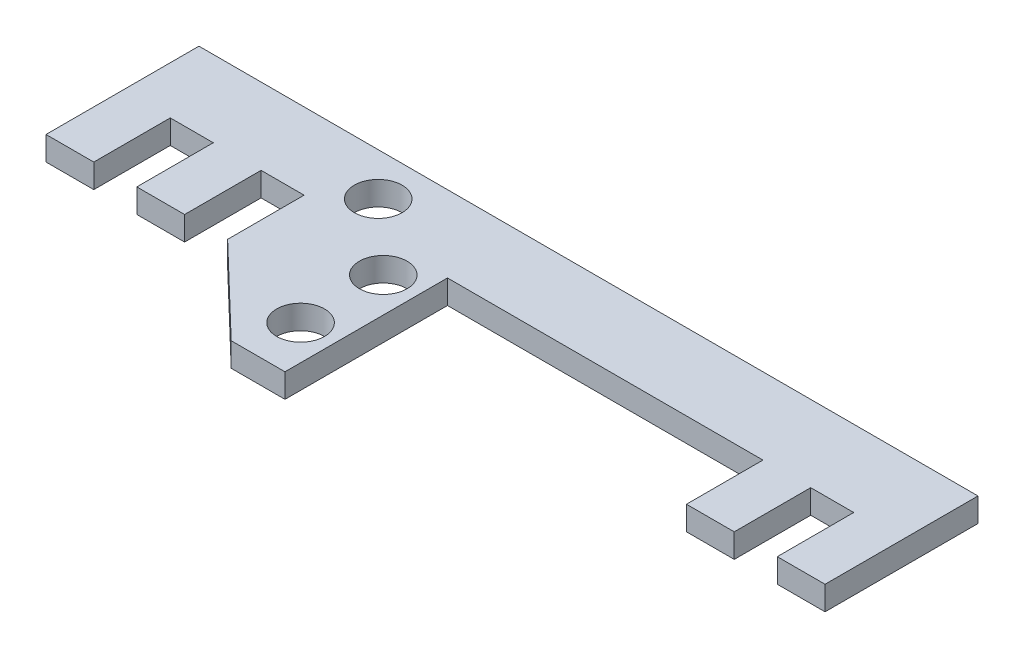
ISO-10303-21;
HEADER;
FILE_DESCRIPTION(('STEP AP214'),'2;1');
FILE_NAME('part.step','',(''),(''),'','','');
FILE_SCHEMA(('AUTOMOTIVE_DESIGN { 1 0 10303 214 1 1 1 1 }'));
ENDSEC;
DATA;
#1=APPLICATION_CONTEXT('core data for automotive mechanical design processes');
#2=APPLICATION_PROTOCOL_DEFINITION('international standard','automotive_design',2000,#1);
#3=PRODUCT_CONTEXT('',#1,'mechanical');
#4=PRODUCT('Part','Part','',(#3));
#5=PRODUCT_RELATED_PRODUCT_CATEGORY('part','',(#4));
#6=PRODUCT_DEFINITION_FORMATION('','',#4);
#7=PRODUCT_DEFINITION_CONTEXT('part definition',#1,'design');
#8=PRODUCT_DEFINITION('design','',#6,#7);
#9=PRODUCT_DEFINITION_SHAPE('','',#8);
#10=(LENGTH_UNIT() NAMED_UNIT(*) SI_UNIT(.MILLI.,.METRE.));
#11=(NAMED_UNIT(*) PLANE_ANGLE_UNIT() SI_UNIT($,.RADIAN.));
#12=(NAMED_UNIT(*) SI_UNIT($,.STERADIAN.) SOLID_ANGLE_UNIT());
#13=UNCERTAINTY_MEASURE_WITH_UNIT(LENGTH_MEASURE(1.E-05),#10,'distance_accuracy_value','');
#14=(GEOMETRIC_REPRESENTATION_CONTEXT(3) GLOBAL_UNCERTAINTY_ASSIGNED_CONTEXT((#13)) GLOBAL_UNIT_ASSIGNED_CONTEXT((#10,
#11,#12)) REPRESENTATION_CONTEXT('',''));
#15=CARTESIAN_POINT('',(0.,0.,0.));
#16=DIRECTION('',(0.,0.,1.));
#17=DIRECTION('',(1.,0.,0.));
#18=AXIS2_PLACEMENT_3D('',#15,#16,#17);
#19=CARTESIAN_POINT('',(0.,1.,0.));
#20=DIRECTION('',(0.,0.,-1.));
#21=DIRECTION('',(-1.,0.,0.));
#22=AXIS2_PLACEMENT_3D('',#19,#20,#21);
#23=PLANE('',#22);
#24=DIRECTION('',(1.,0.,0.));
#25=VECTOR('',#24,1.);
#26=CARTESIAN_POINT('',(0.,0.,0.));
#27=LINE('',#26,#25);
#28=CARTESIAN_POINT('',(0.,0.,0.));
#29=VERTEX_POINT('',#28);
#30=CARTESIAN_POINT('',(2.,0.,0.));
#31=VERTEX_POINT('',#30);
#32=EDGE_CURVE('E208',#29,#31,#27,.T.);
#33=ORIENTED_EDGE('',*,*,#32,.T.);
#34=DIRECTION('',(0.,-1.,0.));
#35=VECTOR('',#34,1.);
#36=CARTESIAN_POINT('',(2.,1.,0.));
#37=LINE('',#36,#35);
#38=CARTESIAN_POINT('',(2.,1.,0.));
#39=VERTEX_POINT('',#38);
#40=EDGE_CURVE('E11',#39,#31,#37,.T.);
#41=ORIENTED_EDGE('',*,*,#40,.F.);
#42=DIRECTION('',(1.,0.,0.));
#43=VECTOR('',#42,1.);
#44=CARTESIAN_POINT('',(0.,1.,0.));
#45=LINE('',#44,#43);
#46=CARTESIAN_POINT('',(0.,1.,0.));
#47=VERTEX_POINT('',#46);
#48=EDGE_CURVE('E249',#47,#39,#45,.T.);
#49=ORIENTED_EDGE('',*,*,#48,.F.);
#50=DIRECTION('',(0.,-1.,0.));
#51=VECTOR('',#50,1.);
#52=CARTESIAN_POINT('',(0.,1.,0.));
#53=LINE('',#52,#51);
#54=EDGE_CURVE('E204',#47,#29,#53,.T.);
#55=ORIENTED_EDGE('',*,*,#54,.T.);
#56=EDGE_LOOP('',(#33,#41,#49,#55));
#57=FACE_BOUND('',#56,.T.);
#58=ADVANCED_FACE('F34',(#57),#23,.F.);
#59=CARTESIAN_POINT('',(2.,1.,0.));
#60=DIRECTION('',(-1.,0.,0.));
#61=DIRECTION('',(0.,0.,1.));
#62=AXIS2_PLACEMENT_3D('',#59,#60,#61);
#63=PLANE('',#62);
#64=DIRECTION('',(0.,0.,-1.));
#65=VECTOR('',#64,1.);
#66=CARTESIAN_POINT('',(2.,0.,0.));
#67=LINE('',#66,#65);
#68=CARTESIAN_POINT('',(2.,0.,-3.2));
#69=VERTEX_POINT('',#68);
#70=EDGE_CURVE('E211',#31,#69,#67,.T.);
#71=ORIENTED_EDGE('',*,*,#70,.T.);
#72=DIRECTION('',(0.,-1.,0.));
#73=VECTOR('',#72,1.);
#74=CARTESIAN_POINT('',(2.,1.,-3.2));
#75=LINE('',#74,#73);
#76=CARTESIAN_POINT('',(2.,1.,-3.2));
#77=VERTEX_POINT('',#76);
#78=EDGE_CURVE('E42',#77,#69,#75,.T.);
#79=ORIENTED_EDGE('',*,*,#78,.F.);
#80=DIRECTION('',(0.,0.,-1.));
#81=VECTOR('',#80,1.);
#82=CARTESIAN_POINT('',(2.,1.,0.));
#83=LINE('',#82,#81);
#84=EDGE_CURVE('E132',#39,#77,#83,.T.);
#85=ORIENTED_EDGE('',*,*,#84,.F.);
#86=ORIENTED_EDGE('',*,*,#40,.T.);
#87=EDGE_LOOP('',(#71,#79,#85,#86));
#88=FACE_BOUND('',#87,.T.);
#89=ADVANCED_FACE('F373',(#88),#63,.F.);
#90=CARTESIAN_POINT('',(2.,1.,-3.2));
#91=DIRECTION('',(0.,0.,-1.));
#92=DIRECTION('',(-1.,0.,0.));
#93=AXIS2_PLACEMENT_3D('',#90,#91,#92);
#94=PLANE('',#93);
#95=DIRECTION('',(1.,0.,0.));
#96=VECTOR('',#95,1.);
#97=CARTESIAN_POINT('',(2.,0.,-3.2));
#98=LINE('',#97,#96);
#99=CARTESIAN_POINT('',(3.8,0.,-3.2));
#100=VERTEX_POINT('',#99);
#101=EDGE_CURVE('E214',#69,#100,#98,.T.);
#102=ORIENTED_EDGE('',*,*,#101,.T.);
#103=DIRECTION('',(0.,-1.,0.));
#104=VECTOR('',#103,1.);
#105=CARTESIAN_POINT('',(3.8,1.,-3.2));
#106=LINE('',#105,#104);
#107=CARTESIAN_POINT('',(3.8,1.,-3.2));
#108=VERTEX_POINT('',#107);
#109=EDGE_CURVE('E295',#108,#100,#106,.T.);
#110=ORIENTED_EDGE('',*,*,#109,.F.);
#111=DIRECTION('',(1.,0.,0.));
#112=VECTOR('',#111,1.);
#113=CARTESIAN_POINT('',(2.,1.,-3.2));
#114=LINE('',#113,#112);
#115=EDGE_CURVE('E303',#77,#108,#114,.T.);
#116=ORIENTED_EDGE('',*,*,#115,.F.);
#117=ORIENTED_EDGE('',*,*,#78,.T.);
#118=EDGE_LOOP('',(#102,#110,#116,#117));
#119=FACE_BOUND('',#118,.T.);
#120=ADVANCED_FACE('F301',(#119),#94,.F.);
#121=CARTESIAN_POINT('',(3.8,1.,-3.2));
#122=DIRECTION('',(1.,0.,0.));
#123=DIRECTION('',(0.,0.,-1.));
#124=AXIS2_PLACEMENT_3D('',#121,#122,#123);
#125=PLANE('',#124);
#126=DIRECTION('',(0.,0.,1.));
#127=VECTOR('',#126,1.);
#128=CARTESIAN_POINT('',(3.8,0.,-3.2));
#129=LINE('',#128,#127);
#130=CARTESIAN_POINT('',(3.8,0.,0.));
#131=VERTEX_POINT('',#130);
#132=EDGE_CURVE('E216',#100,#131,#129,.T.);
#133=ORIENTED_EDGE('',*,*,#132,.T.);
#134=DIRECTION('',(0.,-1.,0.));
#135=VECTOR('',#134,1.);
#136=CARTESIAN_POINT('',(3.8,1.,0.));
#137=LINE('',#136,#135);
#138=CARTESIAN_POINT('',(3.8,1.,0.));
#139=VERTEX_POINT('',#138);
#140=EDGE_CURVE('E292',#139,#131,#137,.T.);
#141=ORIENTED_EDGE('',*,*,#140,.F.);
#142=DIRECTION('',(0.,0.,1.));
#143=VECTOR('',#142,1.);
#144=CARTESIAN_POINT('',(3.8,1.,-3.2));
#145=LINE('',#144,#143);
#146=EDGE_CURVE('E321',#108,#139,#145,.T.);
#147=ORIENTED_EDGE('',*,*,#146,.F.);
#148=ORIENTED_EDGE('',*,*,#109,.T.);
#149=EDGE_LOOP('',(#133,#141,#147,#148));
#150=FACE_BOUND('',#149,.T.);
#151=ADVANCED_FACE('F312',(#150),#125,.F.);
#152=CARTESIAN_POINT('',(3.8,1.,0.));
#153=DIRECTION('',(0.,0.,-1.));
#154=DIRECTION('',(-1.,0.,0.));
#155=AXIS2_PLACEMENT_3D('',#152,#153,#154);
#156=PLANE('',#155);
#157=DIRECTION('',(1.,0.,0.));
#158=VECTOR('',#157,1.);
#159=CARTESIAN_POINT('',(3.8,0.,0.));
#160=LINE('',#159,#158);
#161=CARTESIAN_POINT('',(5.8,0.,0.));
#162=VERTEX_POINT('',#161);
#163=EDGE_CURVE('E218',#131,#162,#160,.T.);
#164=ORIENTED_EDGE('',*,*,#163,.T.);
#165=DIRECTION('',(0.,-1.,0.));
#166=VECTOR('',#165,1.);
#167=CARTESIAN_POINT('',(5.8,1.,0.));
#168=LINE('',#167,#166);
#169=CARTESIAN_POINT('',(5.8,1.,0.));
#170=VERTEX_POINT('',#169);
#171=EDGE_CURVE('E289',#170,#162,#168,.T.);
#172=ORIENTED_EDGE('',*,*,#171,.F.);
#173=DIRECTION('',(1.,0.,0.));
#174=VECTOR('',#173,1.);
#175=CARTESIAN_POINT('',(3.8,1.,0.));
#176=LINE('',#175,#174);
#177=EDGE_CURVE('E318',#139,#170,#176,.T.);
#178=ORIENTED_EDGE('',*,*,#177,.F.);
#179=ORIENTED_EDGE('',*,*,#140,.T.);
#180=EDGE_LOOP('',(#164,#172,#178,#179));
#181=FACE_BOUND('',#180,.T.);
#182=ADVANCED_FACE('F316',(#181),#156,.F.);
#183=CARTESIAN_POINT('',(5.8,1.,0.));
#184=DIRECTION('',(-1.,0.,0.));
#185=DIRECTION('',(0.,0.,1.));
#186=AXIS2_PLACEMENT_3D('',#183,#184,#185);
#187=PLANE('',#186);
#188=DIRECTION('',(0.,0.,-1.));
#189=VECTOR('',#188,1.);
#190=CARTESIAN_POINT('',(5.8,0.,0.));
#191=LINE('',#190,#189);
#192=CARTESIAN_POINT('',(5.8,0.,-3.2));
#193=VERTEX_POINT('',#192);
#194=EDGE_CURVE('E220',#162,#193,#191,.T.);
#195=ORIENTED_EDGE('',*,*,#194,.T.);
#196=DIRECTION('',(0.,-1.,0.));
#197=VECTOR('',#196,1.);
#198=CARTESIAN_POINT('',(5.8,1.,-3.2));
#199=LINE('',#198,#197);
#200=CARTESIAN_POINT('',(5.8,1.,-3.2));
#201=VERTEX_POINT('',#200);
#202=EDGE_CURVE('E286',#201,#193,#199,.T.);
#203=ORIENTED_EDGE('',*,*,#202,.F.);
#204=DIRECTION('',(0.,0.,-1.));
#205=VECTOR('',#204,1.);
#206=CARTESIAN_POINT('',(5.8,1.,0.));
#207=LINE('',#206,#205);
#208=EDGE_CURVE('E320',#170,#201,#207,.T.);
#209=ORIENTED_EDGE('',*,*,#208,.F.);
#210=ORIENTED_EDGE('',*,*,#171,.T.);
#211=EDGE_LOOP('',(#195,#203,#209,#210));
#212=FACE_BOUND('',#211,.T.);
#213=ADVANCED_FACE('F386',(#212),#187,.F.);
#214=CARTESIAN_POINT('',(5.8,1.,-3.2));
#215=DIRECTION('',(0.,0.,-1.));
#216=DIRECTION('',(-1.,0.,0.));
#217=AXIS2_PLACEMENT_3D('',#214,#215,#216);
#218=PLANE('',#217);
#219=DIRECTION('',(1.,0.,0.));
#220=VECTOR('',#219,1.);
#221=CARTESIAN_POINT('',(5.8,0.,-3.2));
#222=LINE('',#221,#220);
#223=CARTESIAN_POINT('',(7.6,0.,-3.2));
#224=VERTEX_POINT('',#223);
#225=EDGE_CURVE('E222',#193,#224,#222,.T.);
#226=ORIENTED_EDGE('',*,*,#225,.T.);
#227=DIRECTION('',(0.,-1.,0.));
#228=VECTOR('',#227,1.);
#229=CARTESIAN_POINT('',(7.6,1.,-3.2));
#230=LINE('',#229,#228);
#231=CARTESIAN_POINT('',(7.6,1.,-3.2));
#232=VERTEX_POINT('',#231);
#233=EDGE_CURVE('E283',#232,#224,#230,.T.);
#234=ORIENTED_EDGE('',*,*,#233,.F.);
#235=DIRECTION('',(1.,0.,0.));
#236=VECTOR('',#235,1.);
#237=CARTESIAN_POINT('',(5.8,1.,-3.2));
#238=LINE('',#237,#236);
#239=EDGE_CURVE('E323',#201,#232,#238,.T.);
#240=ORIENTED_EDGE('',*,*,#239,.F.);
#241=ORIENTED_EDGE('',*,*,#202,.T.);
#242=EDGE_LOOP('',(#226,#234,#240,#241));
#243=FACE_BOUND('',#242,.T.);
#244=ADVANCED_FACE('F389',(#243),#218,.F.);
#245=CARTESIAN_POINT('',(7.6,1.,-3.2));
#246=DIRECTION('',(1.,0.,0.));
#247=DIRECTION('',(0.,0.,-1.));
#248=AXIS2_PLACEMENT_3D('',#245,#246,#247);
#249=PLANE('',#248);
#250=DIRECTION('',(0.,0.,1.));
#251=VECTOR('',#250,1.);
#252=CARTESIAN_POINT('',(7.6,0.,-3.2));
#253=LINE('',#252,#251);
#254=CARTESIAN_POINT('',(7.6,0.,0.));
#255=VERTEX_POINT('',#254);
#256=EDGE_CURVE('E224',#224,#255,#253,.T.);
#257=ORIENTED_EDGE('',*,*,#256,.T.);
#258=DIRECTION('',(0.,-1.,0.));
#259=VECTOR('',#258,1.);
#260=CARTESIAN_POINT('',(7.6,1.,0.));
#261=LINE('',#260,#259);
#262=CARTESIAN_POINT('',(7.6,1.,0.));
#263=VERTEX_POINT('',#262);
#264=EDGE_CURVE('E280',#263,#255,#261,.T.);
#265=ORIENTED_EDGE('',*,*,#264,.F.);
#266=DIRECTION('',(0.,0.,1.));
#267=VECTOR('',#266,1.);
#268=CARTESIAN_POINT('',(7.6,1.,-3.2));
#269=LINE('',#268,#267);
#270=EDGE_CURVE('E329',#232,#263,#269,.T.);
#271=ORIENTED_EDGE('',*,*,#270,.F.);
#272=ORIENTED_EDGE('',*,*,#233,.T.);
#273=EDGE_LOOP('',(#257,#265,#271,#272));
#274=FACE_BOUND('',#273,.T.);
#275=ADVANCED_FACE('F393',(#274),#249,.F.);
#276=CARTESIAN_POINT('',(7.6,1.,0.));
#277=DIRECTION('',(0.692531828189713,0.,-0.721387321030952));
#278=DIRECTION('',(-0.721387321030952,0.,-0.692531828189713));
#279=AXIS2_PLACEMENT_3D('',#276,#277,#278);
#280=PLANE('',#279);
#281=DIRECTION('',(0.721387321030952,0.,0.692531828189713));
#282=VECTOR('',#281,1.);
#283=CARTESIAN_POINT('',(7.6,0.,0.));
#284=LINE('',#283,#282);
#285=CARTESIAN_POINT('',(11.35,0.,3.6));
#286=VERTEX_POINT('',#285);
#287=EDGE_CURVE('E226',#255,#286,#284,.T.);
#288=ORIENTED_EDGE('',*,*,#287,.T.);
#289=DIRECTION('',(0.,-1.,0.));
#290=VECTOR('',#289,1.);
#291=CARTESIAN_POINT('',(11.35,1.,3.6));
#292=LINE('',#291,#290);
#293=CARTESIAN_POINT('',(11.35,1.,3.6));
#294=VERTEX_POINT('',#293);
#295=EDGE_CURVE('E277',#294,#286,#292,.T.);
#296=ORIENTED_EDGE('',*,*,#295,.F.);
#297=DIRECTION('',(0.721387321030952,0.,0.692531828189713));
#298=VECTOR('',#297,1.);
#299=CARTESIAN_POINT('',(7.6,1.,0.));
#300=LINE('',#299,#298);
#301=EDGE_CURVE('E331',#263,#294,#300,.T.);
#302=ORIENTED_EDGE('',*,*,#301,.F.);
#303=ORIENTED_EDGE('',*,*,#264,.T.);
#304=EDGE_LOOP('',(#288,#296,#302,#303));
#305=FACE_BOUND('',#304,.T.);
#306=ADVANCED_FACE('F397',(#305),#280,.F.);
#307=CARTESIAN_POINT('',(13.6,1.,3.6));
#308=DIRECTION('',(0.,0.,-1.));
#309=DIRECTION('',(-1.,0.,0.));
#310=AXIS2_PLACEMENT_3D('',#307,#308,#309);
#311=PLANE('',#310);
#312=DIRECTION('',(1.,0.,0.));
#313=VECTOR('',#312,1.);
#314=CARTESIAN_POINT('',(13.6,0.,3.6));
#315=LINE('',#314,#313);
#316=CARTESIAN_POINT('',(13.6,0.,3.6));
#317=VERTEX_POINT('',#316);
#318=EDGE_CURVE('E228',#286,#317,#315,.T.);
#319=ORIENTED_EDGE('',*,*,#318,.T.);
#320=DIRECTION('',(0.,-1.,0.));
#321=VECTOR('',#320,1.);
#322=CARTESIAN_POINT('',(13.6,1.,3.6));
#323=LINE('',#322,#321);
#324=CARTESIAN_POINT('',(13.6,1.,3.6));
#325=VERTEX_POINT('',#324);
#326=EDGE_CURVE('E274',#325,#317,#323,.T.);
#327=ORIENTED_EDGE('',*,*,#326,.F.);
#328=DIRECTION('',(1.,0.,0.));
#329=VECTOR('',#328,1.);
#330=CARTESIAN_POINT('',(13.6,1.,3.6));
#331=LINE('',#330,#329);
#332=EDGE_CURVE('E333',#294,#325,#331,.T.);
#333=ORIENTED_EDGE('',*,*,#332,.F.);
#334=ORIENTED_EDGE('',*,*,#295,.T.);
#335=EDGE_LOOP('',(#319,#327,#333,#334));
#336=FACE_BOUND('',#335,.T.);
#337=ADVANCED_FACE('F401',(#336),#311,.F.);
#338=CARTESIAN_POINT('',(13.6,1.,-3.2));
#339=DIRECTION('',(-1.,0.,0.));
#340=DIRECTION('',(0.,0.,1.));
#341=AXIS2_PLACEMENT_3D('',#338,#339,#340);
#342=PLANE('',#341);
#343=DIRECTION('',(0.,0.,-1.));
#344=VECTOR('',#343,1.);
#345=CARTESIAN_POINT('',(13.6,0.,-3.2));
#346=LINE('',#345,#344);
#347=CARTESIAN_POINT('',(13.6,0.,-3.2));
#348=VERTEX_POINT('',#347);
#349=EDGE_CURVE('E230',#317,#348,#346,.T.);
#350=ORIENTED_EDGE('',*,*,#349,.T.);
#351=DIRECTION('',(0.,-1.,0.));
#352=VECTOR('',#351,1.);
#353=CARTESIAN_POINT('',(13.6,1.,-3.2));
#354=LINE('',#353,#352);
#355=CARTESIAN_POINT('',(13.6,1.,-3.2));
#356=VERTEX_POINT('',#355);
#357=EDGE_CURVE('E271',#356,#348,#354,.T.);
#358=ORIENTED_EDGE('',*,*,#357,.F.);
#359=DIRECTION('',(0.,0.,-1.));
#360=VECTOR('',#359,1.);
#361=CARTESIAN_POINT('',(13.6,1.,-3.2));
#362=LINE('',#361,#360);
#363=EDGE_CURVE('E335',#325,#356,#362,.T.);
#364=ORIENTED_EDGE('',*,*,#363,.F.);
#365=ORIENTED_EDGE('',*,*,#326,.T.);
#366=EDGE_LOOP('',(#350,#358,#364,#365));
#367=FACE_BOUND('',#366,.T.);
#368=ADVANCED_FACE('F405',(#367),#342,.F.);
#369=CARTESIAN_POINT('',(26.8,1.,-3.2));
#370=DIRECTION('',(0.,0.,-1.));
#371=DIRECTION('',(-1.,0.,0.));
#372=AXIS2_PLACEMENT_3D('',#369,#370,#371);
#373=PLANE('',#372);
#374=DIRECTION('',(1.,0.,0.));
#375=VECTOR('',#374,1.);
#376=CARTESIAN_POINT('',(26.8,0.,-3.2));
#377=LINE('',#376,#375);
#378=CARTESIAN_POINT('',(26.8,0.,-3.2));
#379=VERTEX_POINT('',#378);
#380=EDGE_CURVE('E232',#348,#379,#377,.T.);
#381=ORIENTED_EDGE('',*,*,#380,.T.);
#382=DIRECTION('',(0.,-1.,0.));
#383=VECTOR('',#382,1.);
#384=CARTESIAN_POINT('',(26.8,1.,-3.2));
#385=LINE('',#384,#383);
#386=CARTESIAN_POINT('',(26.8,1.,-3.2));
#387=VERTEX_POINT('',#386);
#388=EDGE_CURVE('E268',#387,#379,#385,.T.);
#389=ORIENTED_EDGE('',*,*,#388,.F.);
#390=DIRECTION('',(1.,0.,0.));
#391=VECTOR('',#390,1.);
#392=CARTESIAN_POINT('',(26.8,1.,-3.2));
#393=LINE('',#392,#391);
#394=EDGE_CURVE('E337',#356,#387,#393,.T.);
#395=ORIENTED_EDGE('',*,*,#394,.F.);
#396=ORIENTED_EDGE('',*,*,#357,.T.);
#397=EDGE_LOOP('',(#381,#389,#395,#396));
#398=FACE_BOUND('',#397,.T.);
#399=ADVANCED_FACE('F409',(#398),#373,.F.);
#400=CARTESIAN_POINT('',(26.8,1.,0.));
#401=DIRECTION('',(1.,0.,0.));
#402=DIRECTION('',(0.,0.,-1.));
#403=AXIS2_PLACEMENT_3D('',#400,#401,#402);
#404=PLANE('',#403);
#405=DIRECTION('',(0.,0.,1.));
#406=VECTOR('',#405,1.);
#407=CARTESIAN_POINT('',(26.8,0.,0.));
#408=LINE('',#407,#406);
#409=CARTESIAN_POINT('',(26.8,0.,0.));
#410=VERTEX_POINT('',#409);
#411=EDGE_CURVE('E234',#379,#410,#408,.T.);
#412=ORIENTED_EDGE('',*,*,#411,.T.);
#413=DIRECTION('',(0.,-1.,0.));
#414=VECTOR('',#413,1.);
#415=CARTESIAN_POINT('',(26.8,1.,0.));
#416=LINE('',#415,#414);
#417=CARTESIAN_POINT('',(26.8,1.,0.));
#418=VERTEX_POINT('',#417);
#419=EDGE_CURVE('E265',#418,#410,#416,.T.);
#420=ORIENTED_EDGE('',*,*,#419,.F.);
#421=DIRECTION('',(0.,0.,1.));
#422=VECTOR('',#421,1.);
#423=CARTESIAN_POINT('',(26.8,1.,0.));
#424=LINE('',#423,#422);
#425=EDGE_CURVE('E339',#387,#418,#424,.T.);
#426=ORIENTED_EDGE('',*,*,#425,.F.);
#427=ORIENTED_EDGE('',*,*,#388,.T.);
#428=EDGE_LOOP('',(#412,#420,#426,#427));
#429=FACE_BOUND('',#428,.T.);
#430=ADVANCED_FACE('F413',(#429),#404,.F.);
#431=CARTESIAN_POINT('',(28.8,1.,0.));
#432=DIRECTION('',(0.,0.,-1.));
#433=DIRECTION('',(-1.,0.,0.));
#434=AXIS2_PLACEMENT_3D('',#431,#432,#433);
#435=PLANE('',#434);
#436=DIRECTION('',(1.,0.,0.));
#437=VECTOR('',#436,1.);
#438=CARTESIAN_POINT('',(28.8,0.,0.));
#439=LINE('',#438,#437);
#440=CARTESIAN_POINT('',(28.8,0.,0.));
#441=VERTEX_POINT('',#440);
#442=EDGE_CURVE('E236',#410,#441,#439,.T.);
#443=ORIENTED_EDGE('',*,*,#442,.T.);
#444=DIRECTION('',(0.,-1.,0.));
#445=VECTOR('',#444,1.);
#446=CARTESIAN_POINT('',(28.8,1.,0.));
#447=LINE('',#446,#445);
#448=CARTESIAN_POINT('',(28.8,1.,0.));
#449=VERTEX_POINT('',#448);
#450=EDGE_CURVE('E262',#449,#441,#447,.T.);
#451=ORIENTED_EDGE('',*,*,#450,.F.);
#452=DIRECTION('',(1.,0.,0.));
#453=VECTOR('',#452,1.);
#454=CARTESIAN_POINT('',(28.8,1.,0.));
#455=LINE('',#454,#453);
#456=EDGE_CURVE('E341',#418,#449,#455,.T.);
#457=ORIENTED_EDGE('',*,*,#456,.F.);
#458=ORIENTED_EDGE('',*,*,#419,.T.);
#459=EDGE_LOOP('',(#443,#451,#457,#458));
#460=FACE_BOUND('',#459,.T.);
#461=ADVANCED_FACE('F417',(#460),#435,.F.);
#462=CARTESIAN_POINT('',(28.8,1.,-3.2));
#463=DIRECTION('',(-1.,0.,0.));
#464=DIRECTION('',(0.,0.,1.));
#465=AXIS2_PLACEMENT_3D('',#462,#463,#464);
#466=PLANE('',#465);
#467=DIRECTION('',(0.,0.,-1.));
#468=VECTOR('',#467,1.);
#469=CARTESIAN_POINT('',(28.8,0.,-3.2));
#470=LINE('',#469,#468);
#471=CARTESIAN_POINT('',(28.8,0.,-3.2));
#472=VERTEX_POINT('',#471);
#473=EDGE_CURVE('E238',#441,#472,#470,.T.);
#474=ORIENTED_EDGE('',*,*,#473,.T.);
#475=DIRECTION('',(0.,-1.,0.));
#476=VECTOR('',#475,1.);
#477=CARTESIAN_POINT('',(28.8,1.,-3.2));
#478=LINE('',#477,#476);
#479=CARTESIAN_POINT('',(28.8,1.,-3.2));
#480=VERTEX_POINT('',#479);
#481=EDGE_CURVE('E259',#480,#472,#478,.T.);
#482=ORIENTED_EDGE('',*,*,#481,.F.);
#483=DIRECTION('',(0.,0.,-1.));
#484=VECTOR('',#483,1.);
#485=CARTESIAN_POINT('',(28.8,1.,-3.2));
#486=LINE('',#485,#484);
#487=EDGE_CURVE('E343',#449,#480,#486,.T.);
#488=ORIENTED_EDGE('',*,*,#487,.F.);
#489=ORIENTED_EDGE('',*,*,#450,.T.);
#490=EDGE_LOOP('',(#474,#482,#488,#489));
#491=FACE_BOUND('',#490,.T.);
#492=ADVANCED_FACE('F421',(#491),#466,.F.);
#493=CARTESIAN_POINT('',(30.6,1.,-3.2));
#494=DIRECTION('',(0.,0.,-1.));
#495=DIRECTION('',(-1.,0.,0.));
#496=AXIS2_PLACEMENT_3D('',#493,#494,#495);
#497=PLANE('',#496);
#498=DIRECTION('',(1.,0.,0.));
#499=VECTOR('',#498,1.);
#500=CARTESIAN_POINT('',(30.6,0.,-3.2));
#501=LINE('',#500,#499);
#502=CARTESIAN_POINT('',(30.6,0.,-3.2));
#503=VERTEX_POINT('',#502);
#504=EDGE_CURVE('E240',#472,#503,#501,.T.);
#505=ORIENTED_EDGE('',*,*,#504,.T.);
#506=DIRECTION('',(0.,-1.,0.));
#507=VECTOR('',#506,1.);
#508=CARTESIAN_POINT('',(30.6,1.,-3.2));
#509=LINE('',#508,#507);
#510=CARTESIAN_POINT('',(30.6,1.,-3.2));
#511=VERTEX_POINT('',#510);
#512=EDGE_CURVE('E256',#511,#503,#509,.T.);
#513=ORIENTED_EDGE('',*,*,#512,.F.);
#514=DIRECTION('',(1.,0.,0.));
#515=VECTOR('',#514,1.);
#516=CARTESIAN_POINT('',(30.6,1.,-3.2));
#517=LINE('',#516,#515);
#518=EDGE_CURVE('E345',#480,#511,#517,.T.);
#519=ORIENTED_EDGE('',*,*,#518,.F.);
#520=ORIENTED_EDGE('',*,*,#481,.T.);
#521=EDGE_LOOP('',(#505,#513,#519,#520));
#522=FACE_BOUND('',#521,.T.);
#523=ADVANCED_FACE('F425',(#522),#497,.F.);
#524=CARTESIAN_POINT('',(30.6,1.,0.));
#525=DIRECTION('',(1.,0.,0.));
#526=DIRECTION('',(0.,0.,-1.));
#527=AXIS2_PLACEMENT_3D('',#524,#525,#526);
#528=PLANE('',#527);
#529=DIRECTION('',(0.,0.,1.));
#530=VECTOR('',#529,1.);
#531=CARTESIAN_POINT('',(30.6,0.,0.));
#532=LINE('',#531,#530);
#533=CARTESIAN_POINT('',(30.6,0.,0.));
#534=VERTEX_POINT('',#533);
#535=EDGE_CURVE('E242',#503,#534,#532,.T.);
#536=ORIENTED_EDGE('',*,*,#535,.T.);
#537=DIRECTION('',(0.,-1.,0.));
#538=VECTOR('',#537,1.);
#539=CARTESIAN_POINT('',(30.6,1.,0.));
#540=LINE('',#539,#538);
#541=CARTESIAN_POINT('',(30.6,1.,0.));
#542=VERTEX_POINT('',#541);
#543=EDGE_CURVE('E253',#542,#534,#540,.T.);
#544=ORIENTED_EDGE('',*,*,#543,.F.);
#545=DIRECTION('',(0.,0.,1.));
#546=VECTOR('',#545,1.);
#547=CARTESIAN_POINT('',(30.6,1.,0.));
#548=LINE('',#547,#546);
#549=EDGE_CURVE('E347',#511,#542,#548,.T.);
#550=ORIENTED_EDGE('',*,*,#549,.F.);
#551=ORIENTED_EDGE('',*,*,#512,.T.);
#552=EDGE_LOOP('',(#536,#544,#550,#551));
#553=FACE_BOUND('',#552,.T.);
#554=ADVANCED_FACE('F353',(#553),#528,.F.);
#555=CARTESIAN_POINT('',(32.6,1.,0.));
#556=DIRECTION('',(0.,0.,-1.));
#557=DIRECTION('',(-1.,0.,0.));
#558=AXIS2_PLACEMENT_3D('',#555,#556,#557);
#559=PLANE('',#558);
#560=DIRECTION('',(1.,0.,0.));
#561=VECTOR('',#560,1.);
#562=CARTESIAN_POINT('',(32.6,0.,0.));
#563=LINE('',#562,#561);
#564=CARTESIAN_POINT('',(32.6,0.,0.));
#565=VERTEX_POINT('',#564);
#566=EDGE_CURVE('E244',#534,#565,#563,.T.);
#567=ORIENTED_EDGE('',*,*,#566,.T.);
#568=DIRECTION('',(0.,-1.,0.));
#569=VECTOR('',#568,1.);
#570=CARTESIAN_POINT('',(32.6,1.,0.));
#571=LINE('',#570,#569);
#572=CARTESIAN_POINT('',(32.6,1.,0.));
#573=VERTEX_POINT('',#572);
#574=EDGE_CURVE('E199',#573,#565,#571,.T.);
#575=ORIENTED_EDGE('',*,*,#574,.F.);
#576=DIRECTION('',(1.,0.,0.));
#577=VECTOR('',#576,1.);
#578=CARTESIAN_POINT('',(32.6,1.,0.));
#579=LINE('',#578,#577);
#580=EDGE_CURVE('E190',#542,#573,#579,.T.);
#581=ORIENTED_EDGE('',*,*,#580,.F.);
#582=ORIENTED_EDGE('',*,*,#543,.T.);
#583=EDGE_LOOP('',(#567,#575,#581,#582));
#584=FACE_BOUND('',#583,.T.);
#585=ADVANCED_FACE('F357',(#584),#559,.F.);
#586=CARTESIAN_POINT('',(32.6,1.,-6.4));
#587=DIRECTION('',(-1.,0.,0.));
#588=DIRECTION('',(0.,0.,1.));
#589=AXIS2_PLACEMENT_3D('',#586,#587,#588);
#590=PLANE('',#589);
#591=DIRECTION('',(0.,0.,-1.));
#592=VECTOR('',#591,1.);
#593=CARTESIAN_POINT('',(32.6,0.,-6.4));
#594=LINE('',#593,#592);
#595=CARTESIAN_POINT('',(32.6,0.,-6.4));
#596=VERTEX_POINT('',#595);
#597=EDGE_CURVE('E198',#565,#596,#594,.T.);
#598=ORIENTED_EDGE('',*,*,#597,.T.);
#599=DIRECTION('',(0.,-1.,0.));
#600=VECTOR('',#599,1.);
#601=CARTESIAN_POINT('',(32.6,1.,-6.4));
#602=LINE('',#601,#600);
#603=CARTESIAN_POINT('',(32.6,1.,-6.4));
#604=VERTEX_POINT('',#603);
#605=EDGE_CURVE('E195',#604,#596,#602,.T.);
#606=ORIENTED_EDGE('',*,*,#605,.F.);
#607=DIRECTION('',(0.,0.,-1.));
#608=VECTOR('',#607,1.);
#609=CARTESIAN_POINT('',(32.6,1.,-6.4));
#610=LINE('',#609,#608);
#611=EDGE_CURVE('E184',#573,#604,#610,.T.);
#612=ORIENTED_EDGE('',*,*,#611,.F.);
#613=ORIENTED_EDGE('',*,*,#574,.T.);
#614=EDGE_LOOP('',(#598,#606,#612,#613));
#615=FACE_BOUND('',#614,.T.);
#616=ADVANCED_FACE('F196',(#615),#590,.F.);
#617=CARTESIAN_POINT('',(0.,1.,-6.4));
#618=DIRECTION('',(0.,0.,1.));
#619=DIRECTION('',(1.,0.,0.));
#620=AXIS2_PLACEMENT_3D('',#617,#618,#619);
#621=PLANE('',#620);
#622=DIRECTION('',(-1.,0.,0.));
#623=VECTOR('',#622,1.);
#624=CARTESIAN_POINT('',(0.,0.,-6.4));
#625=LINE('',#624,#623);
#626=CARTESIAN_POINT('',(0.,0.,-6.4));
#627=VERTEX_POINT('',#626);
#628=EDGE_CURVE('E118',#596,#627,#625,.T.);
#629=ORIENTED_EDGE('',*,*,#628,.T.);
#630=DIRECTION('',(0.,-1.,0.));
#631=VECTOR('',#630,1.);
#632=CARTESIAN_POINT('',(0.,1.,-6.4));
#633=LINE('',#632,#631);
#634=CARTESIAN_POINT('',(0.,1.,-6.4));
#635=VERTEX_POINT('',#634);
#636=EDGE_CURVE('E200',#635,#627,#633,.T.);
#637=ORIENTED_EDGE('',*,*,#636,.F.);
#638=DIRECTION('',(-1.,0.,0.));
#639=VECTOR('',#638,1.);
#640=CARTESIAN_POINT('',(0.,1.,-6.4));
#641=LINE('',#640,#639);
#642=EDGE_CURVE('E188',#604,#635,#641,.T.);
#643=ORIENTED_EDGE('',*,*,#642,.F.);
#644=ORIENTED_EDGE('',*,*,#605,.T.);
#645=EDGE_LOOP('',(#629,#637,#643,#644));
#646=FACE_BOUND('',#645,.T.);
#647=ADVANCED_FACE('F202',(#646),#621,.F.);
#648=CARTESIAN_POINT('',(0.,1.,0.));
#649=DIRECTION('',(1.,0.,0.));
#650=DIRECTION('',(0.,0.,-1.));
#651=AXIS2_PLACEMENT_3D('',#648,#649,#650);
#652=PLANE('',#651);
#653=DIRECTION('',(0.,0.,1.));
#654=VECTOR('',#653,1.);
#655=CARTESIAN_POINT('',(0.,0.,0.));
#656=LINE('',#655,#654);
#657=EDGE_CURVE('E124',#627,#29,#656,.T.);
#658=ORIENTED_EDGE('',*,*,#657,.T.);
#659=ORIENTED_EDGE('',*,*,#54,.F.);
#660=DIRECTION('',(0.,0.,1.));
#661=VECTOR('',#660,1.);
#662=CARTESIAN_POINT('',(0.,1.,0.));
#663=LINE('',#662,#661);
#664=EDGE_CURVE('E50',#635,#47,#663,.T.);
#665=ORIENTED_EDGE('',*,*,#664,.F.);
#666=ORIENTED_EDGE('',*,*,#636,.T.);
#667=EDGE_LOOP('',(#658,#659,#665,#666));
#668=FACE_BOUND('',#667,.T.);
#669=ADVANCED_FACE('F361',(#668),#652,.F.);
#670=CARTESIAN_POINT('',(0.,1.,0.));
#671=DIRECTION('',(0.,1.,0.));
#672=DIRECTION('',(0.,0.,1.));
#673=AXIS2_PLACEMENT_3D('',#670,#671,#672);
#674=PLANE('',#673);
#675=CARTESIAN_POINT('',(9.28648883575371,1.,-4.61501018322452));
#676=DIRECTION('',(0.,1.,0.));
#677=DIRECTION('',(0.,0.,1.));
#678=AXIS2_PLACEMENT_3D('',#675,#676,#677);
#679=CIRCLE('',#678,1.);
#680=CARTESIAN_POINT('',(9.28648883575371,1.,-3.61501018322451));
#681=VERTEX_POINT('',#680);
#682=EDGE_CURVE('E498',#681,#681,#679,.T.);
#683=ORIENTED_EDGE('',*,*,#682,.F.);
#684=EDGE_LOOP('',(#683));
#685=FACE_BOUND('',#684,.T.);
#686=CARTESIAN_POINT('',(12.1478252876648,1.,-1.96474725224364));
#687=DIRECTION('',(0.,1.,0.));
#688=DIRECTION('',(0.,0.,1.));
#689=AXIS2_PLACEMENT_3D('',#686,#687,#688);
#690=CIRCLE('',#689,1.);
#691=CARTESIAN_POINT('',(12.1478252876648,1.,-0.964747252243642));
#692=VERTEX_POINT('',#691);
#693=EDGE_CURVE('E505',#692,#692,#690,.T.);
#694=ORIENTED_EDGE('',*,*,#693,.F.);
#695=EDGE_LOOP('',(#694));
#696=FACE_BOUND('',#695,.T.);
#697=CARTESIAN_POINT('',(12.1478252876648,1.,1.49405887303514));
#698=DIRECTION('',(0.,1.,0.));
#699=DIRECTION('',(0.,0.,1.));
#700=AXIS2_PLACEMENT_3D('',#697,#698,#699);
#701=CIRCLE('',#700,1.);
#702=CARTESIAN_POINT('',(12.1478252876648,1.,2.49405887303514));
#703=VERTEX_POINT('',#702);
#704=EDGE_CURVE('E511',#703,#703,#701,.T.);
#705=ORIENTED_EDGE('',*,*,#704,.F.);
#706=EDGE_LOOP('',(#705));
#707=FACE_BOUND('',#706,.T.);
#708=ORIENTED_EDGE('',*,*,#48,.T.);
#709=ORIENTED_EDGE('',*,*,#84,.T.);
#710=ORIENTED_EDGE('',*,*,#115,.T.);
#711=ORIENTED_EDGE('',*,*,#146,.T.);
#712=ORIENTED_EDGE('',*,*,#177,.T.);
#713=ORIENTED_EDGE('',*,*,#208,.T.);
#714=ORIENTED_EDGE('',*,*,#239,.T.);
#715=ORIENTED_EDGE('',*,*,#270,.T.);
#716=ORIENTED_EDGE('',*,*,#301,.T.);
#717=ORIENTED_EDGE('',*,*,#332,.T.);
#718=ORIENTED_EDGE('',*,*,#363,.T.);
#719=ORIENTED_EDGE('',*,*,#394,.T.);
#720=ORIENTED_EDGE('',*,*,#425,.T.);
#721=ORIENTED_EDGE('',*,*,#456,.T.);
#722=ORIENTED_EDGE('',*,*,#487,.T.);
#723=ORIENTED_EDGE('',*,*,#518,.T.);
#724=ORIENTED_EDGE('',*,*,#549,.T.);
#725=ORIENTED_EDGE('',*,*,#580,.T.);
#726=ORIENTED_EDGE('',*,*,#611,.T.);
#727=ORIENTED_EDGE('',*,*,#642,.T.);
#728=ORIENTED_EDGE('',*,*,#664,.T.);
#729=EDGE_LOOP('',(#708,#709,#710,#711,#712,#713,#714,#715,#716,#717,#718,#719,#720,#721,#722,
#723,#724,#725,#726,#727,#728));
#730=FACE_BOUND('',#729,.T.);
#731=ADVANCED_FACE('F186',(#685,#696,#707,#730),#674,.T.);
#732=CARTESIAN_POINT('',(0.,0.,0.));
#733=DIRECTION('',(0.,1.,0.));
#734=DIRECTION('',(0.,0.,1.));
#735=AXIS2_PLACEMENT_3D('',#732,#733,#734);
#736=PLANE('',#735);
#737=CARTESIAN_POINT('',(9.28648883575371,0.,-4.61501018322452));
#738=DIRECTION('',(0.,1.,0.));
#739=DIRECTION('',(0.,0.,1.));
#740=AXIS2_PLACEMENT_3D('',#737,#738,#739);
#741=CIRCLE('',#740,1.);
#742=CARTESIAN_POINT('',(9.28648883575371,0.,-3.61501018322451));
#743=VERTEX_POINT('',#742);
#744=EDGE_CURVE('E212',#743,#743,#741,.F.);
#745=ORIENTED_EDGE('',*,*,#744,.F.);
#746=EDGE_LOOP('',(#745));
#747=FACE_BOUND('',#746,.T.);
#748=CARTESIAN_POINT('',(12.1478252876648,0.,-1.96474725224364));
#749=DIRECTION('',(0.,1.,0.));
#750=DIRECTION('',(0.,0.,1.));
#751=AXIS2_PLACEMENT_3D('',#748,#749,#750);
#752=CIRCLE('',#751,1.);
#753=CARTESIAN_POINT('',(12.1478252876648,0.,-0.964747252243642));
#754=VERTEX_POINT('',#753);
#755=EDGE_CURVE('E502',#754,#754,#752,.F.);
#756=ORIENTED_EDGE('',*,*,#755,.F.);
#757=EDGE_LOOP('',(#756));
#758=FACE_BOUND('',#757,.T.);
#759=CARTESIAN_POINT('',(12.1478252876648,0.,1.49405887303514));
#760=DIRECTION('',(0.,1.,0.));
#761=DIRECTION('',(0.,0.,1.));
#762=AXIS2_PLACEMENT_3D('',#759,#760,#761);
#763=CIRCLE('',#762,1.);
#764=CARTESIAN_POINT('',(12.1478252876648,0.,2.49405887303514));
#765=VERTEX_POINT('',#764);
#766=EDGE_CURVE('E508',#765,#765,#763,.F.);
#767=ORIENTED_EDGE('',*,*,#766,.F.);
#768=EDGE_LOOP('',(#767));
#769=FACE_BOUND('',#768,.T.);
#770=ORIENTED_EDGE('',*,*,#32,.F.);
#771=ORIENTED_EDGE('',*,*,#657,.F.);
#772=ORIENTED_EDGE('',*,*,#628,.F.);
#773=ORIENTED_EDGE('',*,*,#597,.F.);
#774=ORIENTED_EDGE('',*,*,#566,.F.);
#775=ORIENTED_EDGE('',*,*,#535,.F.);
#776=ORIENTED_EDGE('',*,*,#504,.F.);
#777=ORIENTED_EDGE('',*,*,#473,.F.);
#778=ORIENTED_EDGE('',*,*,#442,.F.);
#779=ORIENTED_EDGE('',*,*,#411,.F.);
#780=ORIENTED_EDGE('',*,*,#380,.F.);
#781=ORIENTED_EDGE('',*,*,#349,.F.);
#782=ORIENTED_EDGE('',*,*,#318,.F.);
#783=ORIENTED_EDGE('',*,*,#287,.F.);
#784=ORIENTED_EDGE('',*,*,#256,.F.);
#785=ORIENTED_EDGE('',*,*,#225,.F.);
#786=ORIENTED_EDGE('',*,*,#194,.F.);
#787=ORIENTED_EDGE('',*,*,#163,.F.);
#788=ORIENTED_EDGE('',*,*,#132,.F.);
#789=ORIENTED_EDGE('',*,*,#101,.F.);
#790=ORIENTED_EDGE('',*,*,#70,.F.);
#791=EDGE_LOOP('',(#770,#771,#772,#773,#774,#775,#776,#777,#778,#779,#780,#781,#782,#783,#784,
#785,#786,#787,#788,#789,#790));
#792=FACE_BOUND('',#791,.T.);
#793=ADVANCED_FACE('F307',(#747,#758,#769,#792),#736,.F.);
#794=CARTESIAN_POINT('',(12.1478252876648,-0.000999999999999916,1.49405887303514));
#795=DIRECTION('',(0.,1.,0.));
#796=DIRECTION('',(0.,0.,1.));
#797=AXIS2_PLACEMENT_3D('',#794,#795,#796);
#798=CYLINDRICAL_SURFACE('',#797,1.);
#799=ORIENTED_EDGE('',*,*,#704,.T.);
#800=EDGE_LOOP('',(#799));
#801=FACE_BOUND('',#800,.T.);
#802=ORIENTED_EDGE('',*,*,#766,.T.);
#803=EDGE_LOOP('',(#802));
#804=FACE_BOUND('',#803,.T.);
#805=ADVANCED_FACE('F462',(#801,#804),#798,.F.);
#806=CARTESIAN_POINT('',(12.1478252876648,-0.000999999999999916,-1.96474725224364));
#807=DIRECTION('',(0.,1.,0.));
#808=DIRECTION('',(0.,0.,1.));
#809=AXIS2_PLACEMENT_3D('',#806,#807,#808);
#810=CYLINDRICAL_SURFACE('',#809,1.);
#811=ORIENTED_EDGE('',*,*,#693,.T.);
#812=EDGE_LOOP('',(#811));
#813=FACE_BOUND('',#812,.T.);
#814=ORIENTED_EDGE('',*,*,#755,.T.);
#815=EDGE_LOOP('',(#814));
#816=FACE_BOUND('',#815,.T.);
#817=ADVANCED_FACE('F471',(#813,#816),#810,.F.);
#818=CARTESIAN_POINT('',(9.28648883575371,-0.000999999999999916,-4.61501018322452));
#819=DIRECTION('',(0.,1.,0.));
#820=DIRECTION('',(0.,0.,1.));
#821=AXIS2_PLACEMENT_3D('',#818,#819,#820);
#822=CYLINDRICAL_SURFACE('',#821,1.);
#823=ORIENTED_EDGE('',*,*,#682,.T.);
#824=EDGE_LOOP('',(#823));
#825=FACE_BOUND('',#824,.T.);
#826=ORIENTED_EDGE('',*,*,#744,.T.);
#827=EDGE_LOOP('',(#826));
#828=FACE_BOUND('',#827,.T.);
#829=ADVANCED_FACE('F481',(#825,#828),#822,.F.);
#830=CLOSED_SHELL('',(#58,#89,#120,#151,#182,#213,#244,#275,#306,#337,#368,#399,#430,#461,#492,
#523,#554,#585,#616,#647,#669,#731,#793,#805,#817,#829));
#831=MANIFOLD_SOLID_BREP('B2',#830);
#832=ADVANCED_BREP_SHAPE_REPRESENTATION('',(#18,#831),#14);
#833=SHAPE_DEFINITION_REPRESENTATION(#9,#832);
ENDSEC;
END-ISO-10303-21;
